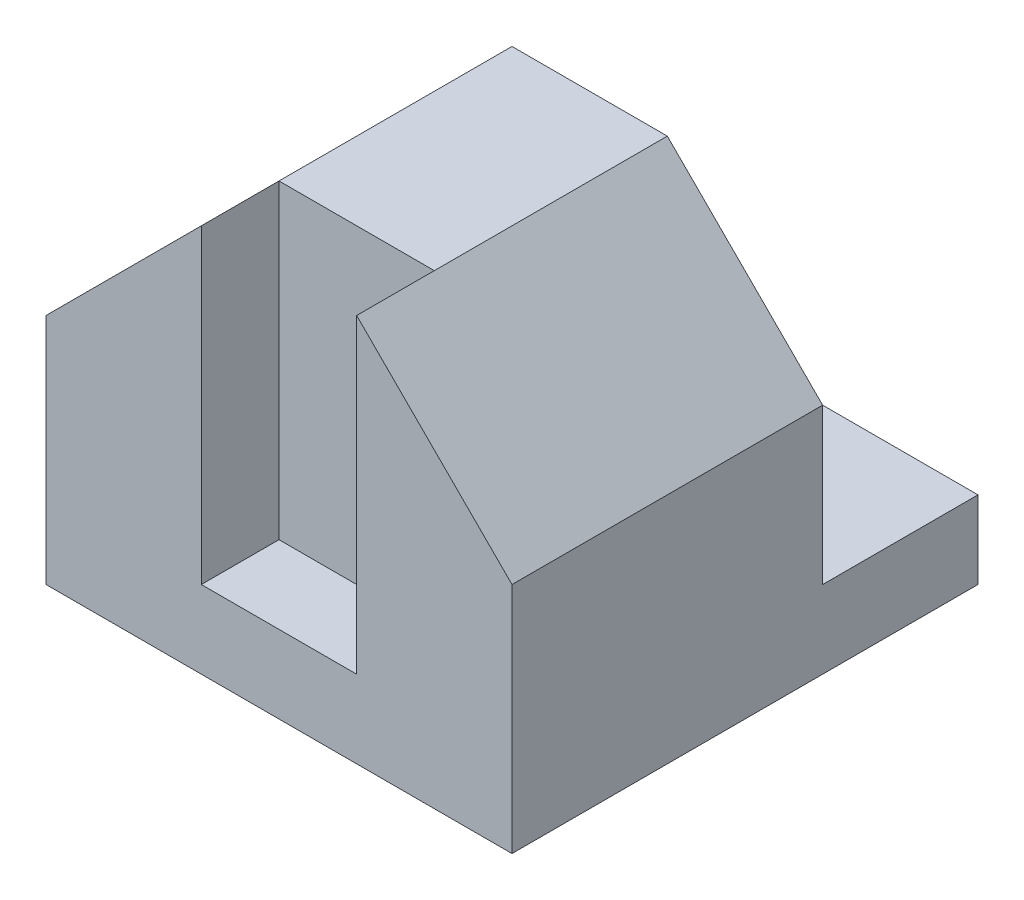
ISO-10303-21;
HEADER;
FILE_DESCRIPTION(('STEP AP214'),'2;1');
FILE_NAME('part.step','',(''),(''),'','','');
FILE_SCHEMA(('AUTOMOTIVE_DESIGN { 1 0 10303 214 1 1 1 1 }'));
ENDSEC;
DATA;
#1=APPLICATION_CONTEXT('core data for automotive mechanical design processes');
#2=APPLICATION_PROTOCOL_DEFINITION('international standard','automotive_design',2000,#1);
#3=PRODUCT_CONTEXT('',#1,'mechanical');
#4=PRODUCT('Part','Part','',(#3));
#5=PRODUCT_RELATED_PRODUCT_CATEGORY('part','',(#4));
#6=PRODUCT_DEFINITION_FORMATION('','',#4);
#7=PRODUCT_DEFINITION_CONTEXT('part definition',#1,'design');
#8=PRODUCT_DEFINITION('design','',#6,#7);
#9=PRODUCT_DEFINITION_SHAPE('','',#8);
#10=(LENGTH_UNIT() NAMED_UNIT(*) SI_UNIT(.MILLI.,.METRE.));
#11=(NAMED_UNIT(*) PLANE_ANGLE_UNIT() SI_UNIT($,.RADIAN.));
#12=(NAMED_UNIT(*) SI_UNIT($,.STERADIAN.) SOLID_ANGLE_UNIT());
#13=UNCERTAINTY_MEASURE_WITH_UNIT(LENGTH_MEASURE(1.E-05),#10,'distance_accuracy_value','');
#14=(GEOMETRIC_REPRESENTATION_CONTEXT(3) GLOBAL_UNCERTAINTY_ASSIGNED_CONTEXT((#13)) GLOBAL_UNIT_ASSIGNED_CONTEXT((#10,
#11,#12)) REPRESENTATION_CONTEXT('',''));
#15=CARTESIAN_POINT('',(0.,0.,0.));
#16=DIRECTION('',(0.,0.,1.));
#17=DIRECTION('',(1.,0.,0.));
#18=AXIS2_PLACEMENT_3D('',#15,#16,#17);
#19=CARTESIAN_POINT('',(3.,5.,3.));
#20=DIRECTION('',(-1.,0.,0.));
#21=DIRECTION('',(0.,0.,1.));
#22=AXIS2_PLACEMENT_3D('',#19,#20,#21);
#23=PLANE('',#22);
#24=DIRECTION('',(0.,-1.,0.));
#25=VECTOR('',#24,1.);
#26=CARTESIAN_POINT('',(3.,5.,-1.));
#27=LINE('',#26,#25);
#28=CARTESIAN_POINT('',(3.,3.,-1.));
#29=VERTEX_POINT('',#28);
#30=CARTESIAN_POINT('',(3.,1.,-1.));
#31=VERTEX_POINT('',#30);
#32=EDGE_CURVE('E167',#29,#31,#27,.T.);
#33=ORIENTED_EDGE('',*,*,#32,.F.);
#34=DIRECTION('',(0.,0.,1.));
#35=VECTOR('',#34,1.);
#36=CARTESIAN_POINT('',(3.,3.,-5.));
#37=LINE('',#36,#35);
#38=CARTESIAN_POINT('',(3.,3.,3.));
#39=VERTEX_POINT('',#38);
#40=EDGE_CURVE('E47',#29,#39,#37,.T.);
#41=ORIENTED_EDGE('',*,*,#40,.T.);
#42=DIRECTION('',(0.,-1.,0.));
#43=VECTOR('',#42,1.);
#44=CARTESIAN_POINT('',(3.,5.,3.));
#45=LINE('',#44,#43);
#46=CARTESIAN_POINT('',(3.,0.,3.));
#47=VERTEX_POINT('',#46);
#48=EDGE_CURVE('E192',#39,#47,#45,.T.);
#49=ORIENTED_EDGE('',*,*,#48,.T.);
#50=DIRECTION('',(0.,0.,-1.));
#51=VECTOR('',#50,1.);
#52=CARTESIAN_POINT('',(3.,0.,3.));
#53=LINE('',#52,#51);
#54=CARTESIAN_POINT('',(3.,0.,-3.));
#55=VERTEX_POINT('',#54);
#56=EDGE_CURVE('E180',#47,#55,#53,.T.);
#57=ORIENTED_EDGE('',*,*,#56,.T.);
#58=DIRECTION('',(0.,-1.,0.));
#59=VECTOR('',#58,1.);
#60=CARTESIAN_POINT('',(3.,5.,-3.));
#61=LINE('',#60,#59);
#62=CARTESIAN_POINT('',(3.,1.,-3.));
#63=VERTEX_POINT('',#62);
#64=EDGE_CURVE('E198',#63,#55,#61,.T.);
#65=ORIENTED_EDGE('',*,*,#64,.F.);
#66=DIRECTION('',(0.,0.,-1.));
#67=VECTOR('',#66,1.);
#68=CARTESIAN_POINT('',(3.,1.,-3.));
#69=LINE('',#68,#67);
#70=EDGE_CURVE('E170',#31,#63,#69,.T.);
#71=ORIENTED_EDGE('',*,*,#70,.F.);
#72=EDGE_LOOP('',(#33,#41,#49,#57,#65,#71));
#73=FACE_BOUND('',#72,.T.);
#74=ADVANCED_FACE('F33',(#73),#23,.F.);
#75=CARTESIAN_POINT('',(-3.,5.,-3.));
#76=DIRECTION('',(0.,0.,1.));
#77=DIRECTION('',(1.,0.,0.));
#78=AXIS2_PLACEMENT_3D('',#75,#76,#77);
#79=PLANE('',#78);
#80=DIRECTION('',(0.,-1.,0.));
#81=VECTOR('',#80,1.);
#82=CARTESIAN_POINT('',(-3.,5.,-3.));
#83=LINE('',#82,#81);
#84=CARTESIAN_POINT('',(-3.,1.,-3.));
#85=VERTEX_POINT('',#84);
#86=CARTESIAN_POINT('',(-3.,0.,-3.));
#87=VERTEX_POINT('',#86);
#88=EDGE_CURVE('E196',#85,#87,#83,.T.);
#89=ORIENTED_EDGE('',*,*,#88,.F.);
#90=DIRECTION('',(1.,0.,0.));
#91=VECTOR('',#90,1.);
#92=CARTESIAN_POINT('',(-5.,1.,-3.));
#93=LINE('',#92,#91);
#94=EDGE_CURVE('E173',#85,#63,#93,.T.);
#95=ORIENTED_EDGE('',*,*,#94,.T.);
#96=ORIENTED_EDGE('',*,*,#64,.T.);
#97=DIRECTION('',(-1.,0.,0.));
#98=VECTOR('',#97,1.);
#99=CARTESIAN_POINT('',(-3.,0.,-3.));
#100=LINE('',#99,#98);
#101=EDGE_CURVE('E183',#55,#87,#100,.T.);
#102=ORIENTED_EDGE('',*,*,#101,.T.);
#103=EDGE_LOOP('',(#89,#95,#96,#102));
#104=FACE_BOUND('',#103,.T.);
#105=ADVANCED_FACE('F233',(#104),#79,.F.);
#106=CARTESIAN_POINT('',(-3.,5.,3.));
#107=DIRECTION('',(1.,0.,0.));
#108=DIRECTION('',(0.,0.,-1.));
#109=AXIS2_PLACEMENT_3D('',#106,#107,#108);
#110=PLANE('',#109);
#111=DIRECTION('',(0.,-1.,0.));
#112=VECTOR('',#111,1.);
#113=CARTESIAN_POINT('',(-3.,5.,3.));
#114=LINE('',#113,#112);
#115=CARTESIAN_POINT('',(-3.,3.,3.));
#116=VERTEX_POINT('',#115);
#117=CARTESIAN_POINT('',(-3.,0.,3.));
#118=VERTEX_POINT('',#117);
#119=EDGE_CURVE('E194',#116,#118,#114,.T.);
#120=ORIENTED_EDGE('',*,*,#119,.F.);
#121=DIRECTION('',(0.,0.,1.));
#122=VECTOR('',#121,1.);
#123=CARTESIAN_POINT('',(-3.,3.,-5.));
#124=LINE('',#123,#122);
#125=CARTESIAN_POINT('',(-3.,3.,-1.));
#126=VERTEX_POINT('',#125);
#127=EDGE_CURVE('E164',#126,#116,#124,.T.);
#128=ORIENTED_EDGE('',*,*,#127,.F.);
#129=DIRECTION('',(0.,-1.,0.));
#130=VECTOR('',#129,1.);
#131=CARTESIAN_POINT('',(-3.,5.,-1.));
#132=LINE('',#131,#130);
#133=CARTESIAN_POINT('',(-3.,1.,-1.));
#134=VERTEX_POINT('',#133);
#135=EDGE_CURVE('E176',#126,#134,#132,.T.);
#136=ORIENTED_EDGE('',*,*,#135,.T.);
#137=DIRECTION('',(0.,0.,-1.));
#138=VECTOR('',#137,1.);
#139=CARTESIAN_POINT('',(-3.,1.,3.));
#140=LINE('',#139,#138);
#141=EDGE_CURVE('E201',#134,#85,#140,.T.);
#142=ORIENTED_EDGE('',*,*,#141,.T.);
#143=ORIENTED_EDGE('',*,*,#88,.T.);
#144=DIRECTION('',(0.,0.,1.));
#145=VECTOR('',#144,1.);
#146=CARTESIAN_POINT('',(-3.,0.,3.));
#147=LINE('',#146,#145);
#148=EDGE_CURVE('E186',#87,#118,#147,.T.);
#149=ORIENTED_EDGE('',*,*,#148,.T.);
#150=EDGE_LOOP('',(#120,#128,#136,#142,#143,#149));
#151=FACE_BOUND('',#150,.T.);
#152=ADVANCED_FACE('F214',(#151),#110,.F.);
#153=CARTESIAN_POINT('',(-3.,5.,3.));
#154=DIRECTION('',(0.,0.,-1.));
#155=DIRECTION('',(-1.,0.,0.));
#156=AXIS2_PLACEMENT_3D('',#153,#154,#155);
#157=PLANE('',#156);
#158=DIRECTION('',(1.,0.,0.));
#159=VECTOR('',#158,1.);
#160=CARTESIAN_POINT('',(-0.999999999999999,1.,3.));
#161=LINE('',#160,#159);
#162=CARTESIAN_POINT('',(-0.999999999999999,1.,3.));
#163=VERTEX_POINT('',#162);
#164=CARTESIAN_POINT('',(1.,1.,3.));
#165=VERTEX_POINT('',#164);
#166=EDGE_CURVE('E142',#163,#165,#161,.T.);
#167=ORIENTED_EDGE('',*,*,#166,.F.);
#168=DIRECTION('',(0.,-1.,0.));
#169=VECTOR('',#168,1.);
#170=CARTESIAN_POINT('',(-0.999999999999999,1.,3.));
#171=LINE('',#170,#169);
#172=CARTESIAN_POINT('',(-0.999999999999999,5.,3.));
#173=VERTEX_POINT('',#172);
#174=EDGE_CURVE('E122',#173,#163,#171,.T.);
#175=ORIENTED_EDGE('',*,*,#174,.F.);
#176=DIRECTION('',(0.707106781186548,0.707106781186548,0.));
#177=VECTOR('',#176,1.);
#178=CARTESIAN_POINT('',(-3.,3.,3.));
#179=LINE('',#178,#177);
#180=EDGE_CURVE('E160',#116,#173,#179,.T.);
#181=ORIENTED_EDGE('',*,*,#180,.F.);
#182=ORIENTED_EDGE('',*,*,#119,.T.);
#183=DIRECTION('',(1.,0.,0.));
#184=VECTOR('',#183,1.);
#185=CARTESIAN_POINT('',(-3.,0.,3.));
#186=LINE('',#185,#184);
#187=EDGE_CURVE('E189',#118,#47,#186,.T.);
#188=ORIENTED_EDGE('',*,*,#187,.T.);
#189=ORIENTED_EDGE('',*,*,#48,.F.);
#190=DIRECTION('',(0.707106781186548,-0.707106781186548,0.));
#191=VECTOR('',#190,1.);
#192=CARTESIAN_POINT('',(3.,3.,3.));
#193=LINE('',#192,#191);
#194=CARTESIAN_POINT('',(1.,5.,3.));
#195=VERTEX_POINT('',#194);
#196=EDGE_CURVE('E151',#195,#39,#193,.T.);
#197=ORIENTED_EDGE('',*,*,#196,.F.);
#198=DIRECTION('',(0.,1.,0.));
#199=VECTOR('',#198,1.);
#200=CARTESIAN_POINT('',(1.,1.,3.));
#201=LINE('',#200,#199);
#202=EDGE_CURVE('E140',#165,#195,#201,.T.);
#203=ORIENTED_EDGE('',*,*,#202,.F.);
#204=EDGE_LOOP('',(#167,#175,#181,#182,#188,#189,#197,#203));
#205=FACE_BOUND('',#204,.T.);
#206=ADVANCED_FACE('F219',(#205),#157,.F.);
#207=CARTESIAN_POINT('',(0.,5.,0.));
#208=DIRECTION('',(0.,-1.,0.));
#209=DIRECTION('',(0.,0.,-1.));
#210=AXIS2_PLACEMENT_3D('',#207,#208,#209);
#211=PLANE('',#210);
#212=DIRECTION('',(0.,0.,1.));
#213=VECTOR('',#212,1.);
#214=CARTESIAN_POINT('',(-0.999999999999999,5.,-5.));
#215=LINE('',#214,#213);
#216=CARTESIAN_POINT('',(-0.999999999999998,5.,-1.));
#217=VERTEX_POINT('',#216);
#218=CARTESIAN_POINT('',(-0.999999999999999,5.,2.));
#219=VERTEX_POINT('',#218);
#220=EDGE_CURVE('E165',#217,#219,#215,.T.);
#221=ORIENTED_EDGE('',*,*,#220,.T.);
#222=DIRECTION('',(-1.,0.,0.));
#223=VECTOR('',#222,1.);
#224=CARTESIAN_POINT('',(-0.999999999999999,5.,2.));
#225=LINE('',#224,#223);
#226=CARTESIAN_POINT('',(1.,5.,2.));
#227=VERTEX_POINT('',#226);
#228=EDGE_CURVE('E127',#227,#219,#225,.T.);
#229=ORIENTED_EDGE('',*,*,#228,.F.);
#230=DIRECTION('',(0.,0.,1.));
#231=VECTOR('',#230,1.);
#232=CARTESIAN_POINT('',(1.,5.,-5.));
#233=LINE('',#232,#231);
#234=CARTESIAN_POINT('',(1.,5.,-1.));
#235=VERTEX_POINT('',#234);
#236=EDGE_CURVE('E157',#235,#227,#233,.T.);
#237=ORIENTED_EDGE('',*,*,#236,.F.);
#238=DIRECTION('',(-1.,0.,0.));
#239=VECTOR('',#238,1.);
#240=CARTESIAN_POINT('',(0.,5.,-1.));
#241=LINE('',#240,#239);
#242=EDGE_CURVE('E54',#235,#217,#241,.T.);
#243=ORIENTED_EDGE('',*,*,#242,.T.);
#244=EDGE_LOOP('',(#221,#229,#237,#243));
#245=FACE_BOUND('',#244,.T.);
#246=ADVANCED_FACE('F222',(#245),#211,.F.);
#247=CARTESIAN_POINT('',(0.,0.,0.));
#248=DIRECTION('',(0.,-1.,0.));
#249=DIRECTION('',(0.,0.,-1.));
#250=AXIS2_PLACEMENT_3D('',#247,#248,#249);
#251=PLANE('',#250);
#252=ORIENTED_EDGE('',*,*,#56,.F.);
#253=ORIENTED_EDGE('',*,*,#187,.F.);
#254=ORIENTED_EDGE('',*,*,#148,.F.);
#255=ORIENTED_EDGE('',*,*,#101,.F.);
#256=EDGE_LOOP('',(#252,#253,#254,#255));
#257=FACE_BOUND('',#256,.T.);
#258=ADVANCED_FACE('F236',(#257),#251,.T.);
#259=CARTESIAN_POINT('',(-5.,1.,-3.));
#260=DIRECTION('',(0.,-1.,0.));
#261=DIRECTION('',(0.,0.,-1.));
#262=AXIS2_PLACEMENT_3D('',#259,#260,#261);
#263=PLANE('',#262);
#264=DIRECTION('',(1.,0.,0.));
#265=VECTOR('',#264,1.);
#266=CARTESIAN_POINT('',(-5.,1.,-1.));
#267=LINE('',#266,#265);
#268=EDGE_CURVE('E172',#134,#31,#267,.T.);
#269=ORIENTED_EDGE('',*,*,#268,.T.);
#270=ORIENTED_EDGE('',*,*,#70,.T.);
#271=ORIENTED_EDGE('',*,*,#94,.F.);
#272=ORIENTED_EDGE('',*,*,#141,.F.);
#273=EDGE_LOOP('',(#269,#270,#271,#272));
#274=FACE_BOUND('',#273,.T.);
#275=ADVANCED_FACE('F230',(#274),#263,.F.);
#276=CARTESIAN_POINT('',(-5.,5.,-1.));
#277=DIRECTION('',(0.,0.,1.));
#278=DIRECTION('',(0.,-1.,0.));
#279=AXIS2_PLACEMENT_3D('',#276,#277,#278);
#280=PLANE('',#279);
#281=ORIENTED_EDGE('',*,*,#242,.F.);
#282=DIRECTION('',(0.707106781186548,-0.707106781186548,0.));
#283=VECTOR('',#282,1.);
#284=CARTESIAN_POINT('',(-2.,8.,-1.));
#285=LINE('',#284,#283);
#286=EDGE_CURVE('E11',#235,#29,#285,.T.);
#287=ORIENTED_EDGE('',*,*,#286,.T.);
#288=ORIENTED_EDGE('',*,*,#32,.T.);
#289=ORIENTED_EDGE('',*,*,#268,.F.);
#290=ORIENTED_EDGE('',*,*,#135,.F.);
#291=DIRECTION('',(0.707106781186548,0.707106781186548,0.));
#292=VECTOR('',#291,1.);
#293=CARTESIAN_POINT('',(-3.,3.,-1.));
#294=LINE('',#293,#292);
#295=EDGE_CURVE('E40',#126,#217,#294,.T.);
#296=ORIENTED_EDGE('',*,*,#295,.T.);
#297=EDGE_LOOP('',(#281,#287,#288,#289,#290,#296));
#298=FACE_BOUND('',#297,.T.);
#299=ADVANCED_FACE('F206',(#298),#280,.F.);
#300=CARTESIAN_POINT('',(-3.,3.,-5.));
#301=DIRECTION('',(0.707106781186547,-0.707106781186547,0.));
#302=DIRECTION('',(0.707106781186548,0.707106781186548,0.));
#303=AXIS2_PLACEMENT_3D('',#300,#301,#302);
#304=PLANE('',#303);
#305=ORIENTED_EDGE('',*,*,#127,.T.);
#306=ORIENTED_EDGE('',*,*,#180,.T.);
#307=DIRECTION('',(0.,0.,1.));
#308=VECTOR('',#307,1.);
#309=CARTESIAN_POINT('',(-0.999999999999999,5.,2.));
#310=LINE('',#309,#308);
#311=EDGE_CURVE('E149',#219,#173,#310,.T.);
#312=ORIENTED_EDGE('',*,*,#311,.F.);
#313=ORIENTED_EDGE('',*,*,#220,.F.);
#314=ORIENTED_EDGE('',*,*,#295,.F.);
#315=EDGE_LOOP('',(#305,#306,#312,#313,#314));
#316=FACE_BOUND('',#315,.T.);
#317=ADVANCED_FACE('F210',(#316),#304,.F.);
#318=CARTESIAN_POINT('',(3.,3.,-5.));
#319=DIRECTION('',(-0.707106781186547,-0.707106781186547,0.));
#320=DIRECTION('',(0.707106781186548,-0.707106781186548,0.));
#321=AXIS2_PLACEMENT_3D('',#318,#319,#320);
#322=PLANE('',#321);
#323=ORIENTED_EDGE('',*,*,#236,.T.);
#324=DIRECTION('',(0.,0.,1.));
#325=VECTOR('',#324,1.);
#326=CARTESIAN_POINT('',(1.,5.,2.));
#327=LINE('',#326,#325);
#328=EDGE_CURVE('E152',#227,#195,#327,.T.);
#329=ORIENTED_EDGE('',*,*,#328,.T.);
#330=ORIENTED_EDGE('',*,*,#196,.T.);
#331=ORIENTED_EDGE('',*,*,#40,.F.);
#332=ORIENTED_EDGE('',*,*,#286,.F.);
#333=EDGE_LOOP('',(#323,#329,#330,#331,#332));
#334=FACE_BOUND('',#333,.T.);
#335=ADVANCED_FACE('F223',(#334),#322,.F.);
#336=CARTESIAN_POINT('',(-0.999999999999999,1.,2.));
#337=DIRECTION('',(-1.,0.,0.));
#338=DIRECTION('',(0.,0.,1.));
#339=AXIS2_PLACEMENT_3D('',#336,#337,#338);
#340=PLANE('',#339);
#341=ORIENTED_EDGE('',*,*,#174,.T.);
#342=DIRECTION('',(0.,0.,1.));
#343=VECTOR('',#342,1.);
#344=CARTESIAN_POINT('',(-0.999999999999999,1.,2.));
#345=LINE('',#344,#343);
#346=CARTESIAN_POINT('',(-0.999999999999999,1.,2.));
#347=VERTEX_POINT('',#346);
#348=EDGE_CURVE('E115',#347,#163,#345,.T.);
#349=ORIENTED_EDGE('',*,*,#348,.F.);
#350=DIRECTION('',(0.,-1.,0.));
#351=VECTOR('',#350,1.);
#352=CARTESIAN_POINT('',(-0.999999999999999,1.,2.));
#353=LINE('',#352,#351);
#354=EDGE_CURVE('E119',#219,#347,#353,.T.);
#355=ORIENTED_EDGE('',*,*,#354,.F.);
#356=ORIENTED_EDGE('',*,*,#311,.T.);
#357=EDGE_LOOP('',(#341,#349,#355,#356));
#358=FACE_BOUND('',#357,.T.);
#359=ADVANCED_FACE('F117',(#358),#340,.F.);
#360=CARTESIAN_POINT('',(1.,1.,2.));
#361=DIRECTION('',(1.,0.,0.));
#362=DIRECTION('',(0.,0.,-1.));
#363=AXIS2_PLACEMENT_3D('',#360,#361,#362);
#364=PLANE('',#363);
#365=ORIENTED_EDGE('',*,*,#202,.T.);
#366=ORIENTED_EDGE('',*,*,#328,.F.);
#367=DIRECTION('',(0.,1.,0.));
#368=VECTOR('',#367,1.);
#369=CARTESIAN_POINT('',(1.,1.,2.));
#370=LINE('',#369,#368);
#371=CARTESIAN_POINT('',(1.,1.,2.));
#372=VERTEX_POINT('',#371);
#373=EDGE_CURVE('E135',#372,#227,#370,.T.);
#374=ORIENTED_EDGE('',*,*,#373,.F.);
#375=DIRECTION('',(0.,0.,1.));
#376=VECTOR('',#375,1.);
#377=CARTESIAN_POINT('',(1.,1.,2.));
#378=LINE('',#377,#376);
#379=EDGE_CURVE('E126',#372,#165,#378,.T.);
#380=ORIENTED_EDGE('',*,*,#379,.T.);
#381=EDGE_LOOP('',(#365,#366,#374,#380));
#382=FACE_BOUND('',#381,.T.);
#383=ADVANCED_FACE('F239',(#382),#364,.F.);
#384=CARTESIAN_POINT('',(-0.999999999999999,1.,2.));
#385=DIRECTION('',(0.,-1.,0.));
#386=DIRECTION('',(0.,0.,-1.));
#387=AXIS2_PLACEMENT_3D('',#384,#385,#386);
#388=PLANE('',#387);
#389=ORIENTED_EDGE('',*,*,#166,.T.);
#390=ORIENTED_EDGE('',*,*,#379,.F.);
#391=DIRECTION('',(1.,0.,0.));
#392=VECTOR('',#391,1.);
#393=CARTESIAN_POINT('',(-0.999999999999999,1.,2.));
#394=LINE('',#393,#392);
#395=EDGE_CURVE('E130',#347,#372,#394,.T.);
#396=ORIENTED_EDGE('',*,*,#395,.F.);
#397=ORIENTED_EDGE('',*,*,#348,.T.);
#398=EDGE_LOOP('',(#389,#390,#396,#397));
#399=FACE_BOUND('',#398,.T.);
#400=ADVANCED_FACE('F131',(#399),#388,.F.);
#401=CARTESIAN_POINT('',(0.,0.,2.));
#402=DIRECTION('',(0.,0.,-1.));
#403=DIRECTION('',(-1.,0.,0.));
#404=AXIS2_PLACEMENT_3D('',#401,#402,#403);
#405=PLANE('',#404);
#406=ORIENTED_EDGE('',*,*,#354,.T.);
#407=ORIENTED_EDGE('',*,*,#395,.T.);
#408=ORIENTED_EDGE('',*,*,#373,.T.);
#409=ORIENTED_EDGE('',*,*,#228,.T.);
#410=EDGE_LOOP('',(#406,#407,#408,#409));
#411=FACE_BOUND('',#410,.T.);
#412=ADVANCED_FACE('F137',(#411),#405,.F.);
#413=CLOSED_SHELL('',(#74,#105,#152,#206,#246,#258,#275,#299,#317,#335,#359,#383,#400,#412));
#414=MANIFOLD_SOLID_BREP('B2',#413);
#415=ADVANCED_BREP_SHAPE_REPRESENTATION('',(#18,#414),#14);
#416=SHAPE_DEFINITION_REPRESENTATION(#9,#415);
ENDSEC;
END-ISO-10303-21;
